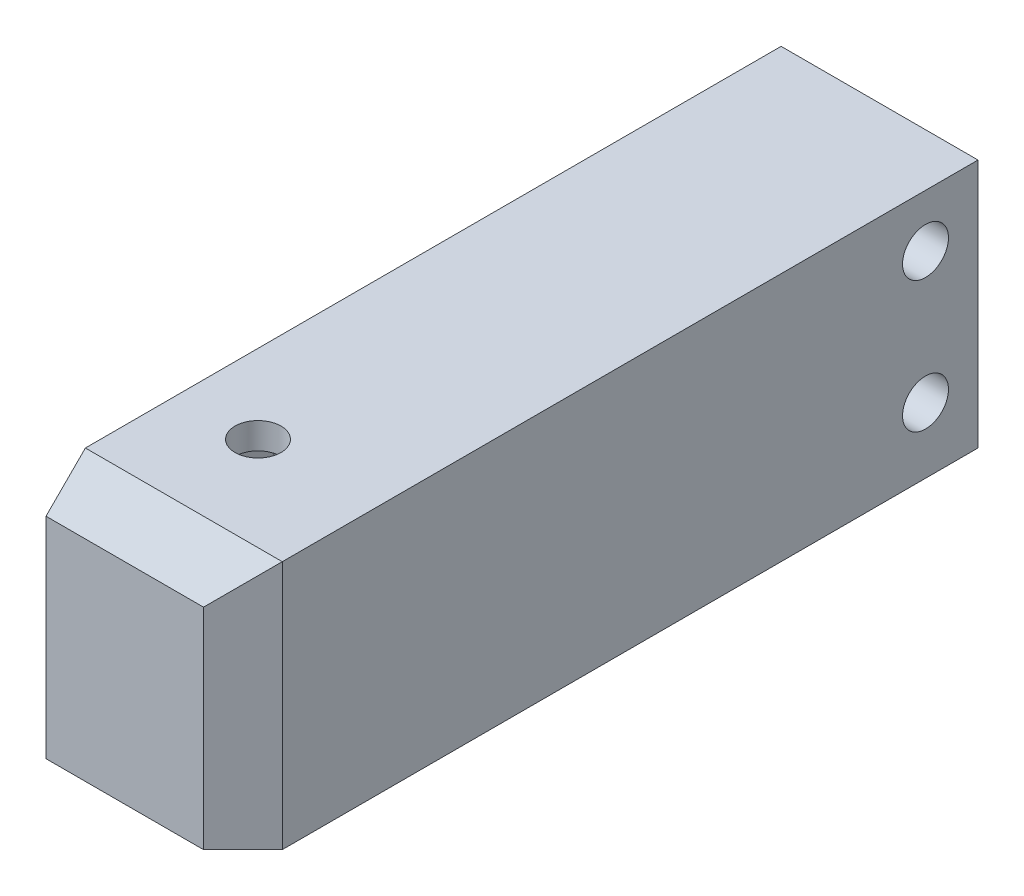
ISO-10303-21;
HEADER;
FILE_DESCRIPTION(('STEP AP214'),'2;1');
FILE_NAME('part.step','',(''),(''),'','','');
FILE_SCHEMA(('AUTOMOTIVE_DESIGN { 1 0 10303 214 1 1 1 1 }'));
ENDSEC;
DATA;
#1=APPLICATION_CONTEXT('core data for automotive mechanical design processes');
#2=APPLICATION_PROTOCOL_DEFINITION('international standard','automotive_design',2000,#1);
#3=PRODUCT_CONTEXT('',#1,'mechanical');
#4=PRODUCT('Part','Part','',(#3));
#5=PRODUCT_RELATED_PRODUCT_CATEGORY('part','',(#4));
#6=PRODUCT_DEFINITION_FORMATION('','',#4);
#7=PRODUCT_DEFINITION_CONTEXT('part definition',#1,'design');
#8=PRODUCT_DEFINITION('design','',#6,#7);
#9=PRODUCT_DEFINITION_SHAPE('','',#8);
#10=(LENGTH_UNIT() NAMED_UNIT(*) SI_UNIT(.MILLI.,.METRE.));
#11=(NAMED_UNIT(*) PLANE_ANGLE_UNIT() SI_UNIT($,.RADIAN.));
#12=(NAMED_UNIT(*) SI_UNIT($,.STERADIAN.) SOLID_ANGLE_UNIT());
#13=UNCERTAINTY_MEASURE_WITH_UNIT(LENGTH_MEASURE(1.E-05),#10,'distance_accuracy_value','');
#14=(GEOMETRIC_REPRESENTATION_CONTEXT(3) GLOBAL_UNCERTAINTY_ASSIGNED_CONTEXT((#13)) GLOBAL_UNIT_ASSIGNED_CONTEXT((#10,
#11,#12)) REPRESENTATION_CONTEXT('',''));
#15=CARTESIAN_POINT('',(0.,0.,0.));
#16=DIRECTION('',(0.,0.,1.));
#17=DIRECTION('',(1.,0.,0.));
#18=AXIS2_PLACEMENT_3D('',#15,#16,#17);
#19=CARTESIAN_POINT('',(-171.,47.,128.35));
#20=DIRECTION('',(0.,1.,0.));
#21=DIRECTION('',(-1.,0.,0.));
#22=AXIS2_PLACEMENT_3D('',#19,#20,#21);
#23=CYLINDRICAL_SURFACE('',#22,1.75);
#24=CARTESIAN_POINT('',(-171.,66.,128.35));
#25=DIRECTION('',(0.,1.,0.));
#26=DIRECTION('',(-1.,0.,0.));
#27=AXIS2_PLACEMENT_3D('',#24,#25,#26);
#28=CIRCLE('',#27,1.75);
#29=CARTESIAN_POINT('',(-172.75,66.,128.35));
#30=VERTEX_POINT('',#29);
#31=EDGE_CURVE('E194',#30,#30,#28,.T.);
#32=ORIENTED_EDGE('',*,*,#31,.T.);
#33=EDGE_LOOP('',(#32));
#34=FACE_BOUND('',#33,.T.);
#35=CARTESIAN_POINT('',(-171.,64.,128.35));
#36=DIRECTION('',(0.,-1.,0.));
#37=DIRECTION('',(1.,0.,0.));
#38=AXIS2_PLACEMENT_3D('',#35,#36,#37);
#39=CIRCLE('',#38,1.75);
#40=CARTESIAN_POINT('',(-169.25,64.,128.35));
#41=VERTEX_POINT('',#40);
#42=EDGE_CURVE('E172',#41,#41,#39,.T.);
#43=ORIENTED_EDGE('',*,*,#42,.T.);
#44=EDGE_LOOP('',(#43));
#45=FACE_BOUND('',#44,.T.);
#46=ADVANCED_FACE('F33',(#34,#45),#23,.F.);
#47=CARTESIAN_POINT('',(-162.,66.,82.5));
#48=DIRECTION('',(0.,0.,-1.));
#49=DIRECTION('',(-1.,0.,0.));
#50=AXIS2_PLACEMENT_3D('',#47,#48,#49);
#51=PLANE('',#50);
#52=DIRECTION('',(0.,-1.,0.));
#53=VECTOR('',#52,1.);
#54=CARTESIAN_POINT('',(-177.,66.,82.5));
#55=LINE('',#54,#53);
#56=CARTESIAN_POINT('',(-177.,66.,82.5));
#57=VERTEX_POINT('',#56);
#58=CARTESIAN_POINT('',(-177.,47.,82.5));
#59=VERTEX_POINT('',#58);
#60=EDGE_CURVE('E263',#57,#59,#55,.T.);
#61=ORIENTED_EDGE('',*,*,#60,.F.);
#62=DIRECTION('',(-1.,0.,0.));
#63=VECTOR('',#62,1.);
#64=CARTESIAN_POINT('',(-162.,66.,82.5));
#65=LINE('',#64,#63);
#66=CARTESIAN_POINT('',(-162.,66.,82.5));
#67=VERTEX_POINT('',#66);
#68=EDGE_CURVE('E274',#67,#57,#65,.T.);
#69=ORIENTED_EDGE('',*,*,#68,.F.);
#70=DIRECTION('',(0.,-1.,0.));
#71=VECTOR('',#70,1.);
#72=CARTESIAN_POINT('',(-162.,66.,82.5));
#73=LINE('',#72,#71);
#74=CARTESIAN_POINT('',(-162.,47.,82.5));
#75=VERTEX_POINT('',#74);
#76=EDGE_CURVE('E253',#67,#75,#73,.T.);
#77=ORIENTED_EDGE('',*,*,#76,.T.);
#78=DIRECTION('',(-1.,0.,0.));
#79=VECTOR('',#78,1.);
#80=CARTESIAN_POINT('',(-162.,47.,82.5));
#81=LINE('',#80,#79);
#82=EDGE_CURVE('E262',#75,#59,#81,.T.);
#83=ORIENTED_EDGE('',*,*,#82,.T.);
#84=EDGE_LOOP('',(#61,#69,#77,#83));
#85=FACE_BOUND('',#84,.T.);
#86=ADVANCED_FACE('F320',(#85),#51,.T.);
#87=CARTESIAN_POINT('',(-162.,66.,138.5));
#88=DIRECTION('',(0.,1.,0.));
#89=DIRECTION('',(-1.,0.,0.));
#90=AXIS2_PLACEMENT_3D('',#87,#88,#89);
#91=PLANE('',#90);
#92=ORIENTED_EDGE('',*,*,#31,.F.);
#93=EDGE_LOOP('',(#92));
#94=FACE_BOUND('',#93,.T.);
#95=DIRECTION('',(0.,0.,-1.));
#96=VECTOR('',#95,1.);
#97=CARTESIAN_POINT('',(-177.,66.,138.5));
#98=LINE('',#97,#96);
#99=CARTESIAN_POINT('',(-177.,66.,135.5));
#100=VERTEX_POINT('',#99);
#101=EDGE_CURVE('E257',#100,#57,#98,.T.);
#102=ORIENTED_EDGE('',*,*,#101,.F.);
#103=DIRECTION('',(1.,0.,0.));
#104=VECTOR('',#103,1.);
#105=CARTESIAN_POINT('',(-162.,66.,135.5));
#106=LINE('',#105,#104);
#107=CARTESIAN_POINT('',(-162.,66.,135.5));
#108=VERTEX_POINT('',#107);
#109=EDGE_CURVE('E11',#100,#108,#106,.T.);
#110=ORIENTED_EDGE('',*,*,#109,.T.);
#111=DIRECTION('',(0.,0.,-1.));
#112=VECTOR('',#111,1.);
#113=CARTESIAN_POINT('',(-162.,66.,138.5));
#114=LINE('',#113,#112);
#115=EDGE_CURVE('E260',#108,#67,#114,.T.);
#116=ORIENTED_EDGE('',*,*,#115,.T.);
#117=ORIENTED_EDGE('',*,*,#68,.T.);
#118=EDGE_LOOP('',(#102,#110,#116,#117));
#119=FACE_BOUND('',#118,.T.);
#120=ADVANCED_FACE('F299',(#94,#119),#91,.T.);
#121=CARTESIAN_POINT('',(-162.,47.,138.5));
#122=DIRECTION('',(0.,0.,1.));
#123=DIRECTION('',(1.,0.,0.));
#124=AXIS2_PLACEMENT_3D('',#121,#122,#123);
#125=PLANE('',#124);
#126=DIRECTION('',(-1.,0.,0.));
#127=VECTOR('',#126,1.);
#128=CARTESIAN_POINT('',(-162.,47.,138.5));
#129=LINE('',#128,#127);
#130=CARTESIAN_POINT('',(-165.,47.,138.5));
#131=VERTEX_POINT('',#130);
#132=CARTESIAN_POINT('',(-177.,47.,138.5));
#133=VERTEX_POINT('',#132);
#134=EDGE_CURVE('E278',#131,#133,#129,.T.);
#135=ORIENTED_EDGE('',*,*,#134,.F.);
#136=DIRECTION('',(0.,1.,0.));
#137=VECTOR('',#136,1.);
#138=CARTESIAN_POINT('',(-165.,66.,138.5));
#139=LINE('',#138,#137);
#140=CARTESIAN_POINT('',(-165.,63.,138.5));
#141=VERTEX_POINT('',#140);
#142=EDGE_CURVE('E283',#131,#141,#139,.T.);
#143=ORIENTED_EDGE('',*,*,#142,.T.);
#144=DIRECTION('',(-1.,0.,0.));
#145=VECTOR('',#144,1.);
#146=CARTESIAN_POINT('',(-162.,63.,138.5));
#147=LINE('',#146,#145);
#148=CARTESIAN_POINT('',(-177.,63.,138.5));
#149=VERTEX_POINT('',#148);
#150=EDGE_CURVE('E277',#141,#149,#147,.T.);
#151=ORIENTED_EDGE('',*,*,#150,.T.);
#152=DIRECTION('',(0.,1.,0.));
#153=VECTOR('',#152,1.);
#154=CARTESIAN_POINT('',(-177.,47.,138.5));
#155=LINE('',#154,#153);
#156=EDGE_CURVE('E270',#133,#149,#155,.T.);
#157=ORIENTED_EDGE('',*,*,#156,.F.);
#158=EDGE_LOOP('',(#135,#143,#151,#157));
#159=FACE_BOUND('',#158,.T.);
#160=ADVANCED_FACE('F380',(#159),#125,.T.);
#161=CARTESIAN_POINT('',(-162.,47.,82.5));
#162=DIRECTION('',(0.,-1.,0.));
#163=DIRECTION('',(1.,0.,0.));
#164=AXIS2_PLACEMENT_3D('',#161,#162,#163);
#165=PLANE('',#164);
#166=CARTESIAN_POINT('',(-171.,47.,108.75));
#167=DIRECTION('',(0.,-1.,0.));
#168=DIRECTION('',(1.,0.,0.));
#169=AXIS2_PLACEMENT_3D('',#166,#167,#168);
#170=CIRCLE('',#169,1.);
#171=CARTESIAN_POINT('',(-170.,47.,108.75));
#172=VERTEX_POINT('',#171);
#173=EDGE_CURVE('E214',#172,#172,#170,.T.);
#174=ORIENTED_EDGE('',*,*,#173,.F.);
#175=EDGE_LOOP('',(#174));
#176=FACE_BOUND('',#175,.T.);
#177=CARTESIAN_POINT('',(-171.,47.,136.25));
#178=DIRECTION('',(0.,-1.,0.));
#179=DIRECTION('',(1.,0.,0.));
#180=AXIS2_PLACEMENT_3D('',#177,#178,#179);
#181=CIRCLE('',#180,1.);
#182=CARTESIAN_POINT('',(-170.,47.,136.25));
#183=VERTEX_POINT('',#182);
#184=EDGE_CURVE('E220',#183,#183,#181,.T.);
#185=ORIENTED_EDGE('',*,*,#184,.F.);
#186=EDGE_LOOP('',(#185));
#187=FACE_BOUND('',#186,.T.);
#188=DIRECTION('',(-1.,0.,0.));
#189=VECTOR('',#188,1.);
#190=CARTESIAN_POINT('',(-164.5,47.,134.5));
#191=LINE('',#190,#189);
#192=CARTESIAN_POINT('',(-164.5,47.,134.5));
#193=VERTEX_POINT('',#192);
#194=CARTESIAN_POINT('',(-177.,47.,134.5));
#195=VERTEX_POINT('',#194);
#196=EDGE_CURVE('E226',#193,#195,#191,.T.);
#197=ORIENTED_EDGE('',*,*,#196,.F.);
#198=DIRECTION('',(0.,0.,1.));
#199=VECTOR('',#198,1.);
#200=CARTESIAN_POINT('',(-164.5,47.,110.5));
#201=LINE('',#200,#199);
#202=CARTESIAN_POINT('',(-164.5,47.,110.5));
#203=VERTEX_POINT('',#202);
#204=EDGE_CURVE('E231',#203,#193,#201,.T.);
#205=ORIENTED_EDGE('',*,*,#204,.F.);
#206=DIRECTION('',(1.,0.,0.));
#207=VECTOR('',#206,1.);
#208=CARTESIAN_POINT('',(-177.,47.,110.5));
#209=LINE('',#208,#207);
#210=CARTESIAN_POINT('',(-177.,47.,110.5));
#211=VERTEX_POINT('',#210);
#212=EDGE_CURVE('E240',#211,#203,#209,.T.);
#213=ORIENTED_EDGE('',*,*,#212,.F.);
#214=DIRECTION('',(0.,0.,1.));
#215=VECTOR('',#214,1.);
#216=CARTESIAN_POINT('',(-177.,47.,82.5));
#217=LINE('',#216,#215);
#218=EDGE_CURVE('E267',#59,#211,#217,.T.);
#219=ORIENTED_EDGE('',*,*,#218,.F.);
#220=ORIENTED_EDGE('',*,*,#82,.F.);
#221=DIRECTION('',(0.,0.,1.));
#222=VECTOR('',#221,1.);
#223=CARTESIAN_POINT('',(-162.,47.,82.5));
#224=LINE('',#223,#222);
#225=CARTESIAN_POINT('',(-162.,47.,135.5));
#226=VERTEX_POINT('',#225);
#227=EDGE_CURVE('E256',#75,#226,#224,.T.);
#228=ORIENTED_EDGE('',*,*,#227,.T.);
#229=DIRECTION('',(-0.707106781186546,0.,0.707106781186549));
#230=VECTOR('',#229,1.);
#231=CARTESIAN_POINT('',(-135.5,47.,109.));
#232=LINE('',#231,#230);
#233=EDGE_CURVE('E288',#226,#131,#232,.T.);
#234=ORIENTED_EDGE('',*,*,#233,.T.);
#235=ORIENTED_EDGE('',*,*,#134,.T.);
#236=EDGE_CURVE('E266',#195,#133,#217,.T.);
#237=ORIENTED_EDGE('',*,*,#236,.F.);
#238=EDGE_LOOP('',(#197,#205,#213,#219,#220,#228,#234,#235,#237));
#239=FACE_BOUND('',#238,.T.);
#240=ADVANCED_FACE('F315',(#176,#187,#239),#165,.T.);
#241=CARTESIAN_POINT('',(-162.,-2.55234430082246E-13,0.));
#242=DIRECTION('',(-1.,0.,0.));
#243=DIRECTION('',(0.,-1.,0.));
#244=AXIS2_PLACEMENT_3D('',#241,#242,#243);
#245=PLANE('',#244);
#246=CARTESIAN_POINT('',(-162.,61.9999999999998,86.5));
#247=DIRECTION('',(1.,0.,0.));
#248=DIRECTION('',(0.,0.,-1.));
#249=AXIS2_PLACEMENT_3D('',#246,#247,#248);
#250=CIRCLE('',#249,1.75);
#251=CARTESIAN_POINT('',(-162.,61.9999999999998,84.75));
#252=VERTEX_POINT('',#251);
#253=EDGE_CURVE('E205',#252,#252,#250,.T.);
#254=ORIENTED_EDGE('',*,*,#253,.F.);
#255=EDGE_LOOP('',(#254));
#256=FACE_BOUND('',#255,.T.);
#257=CARTESIAN_POINT('',(-162.,51.9999999999998,86.5));
#258=DIRECTION('',(1.,0.,0.));
#259=DIRECTION('',(0.,0.,-1.));
#260=AXIS2_PLACEMENT_3D('',#257,#258,#259);
#261=CIRCLE('',#260,1.75);
#262=CARTESIAN_POINT('',(-162.,51.9999999999998,84.75));
#263=VERTEX_POINT('',#262);
#264=EDGE_CURVE('E208',#263,#263,#261,.T.);
#265=ORIENTED_EDGE('',*,*,#264,.F.);
#266=EDGE_LOOP('',(#265));
#267=FACE_BOUND('',#266,.T.);
#268=ORIENTED_EDGE('',*,*,#115,.F.);
#269=DIRECTION('',(0.,-1.,0.));
#270=VECTOR('',#269,1.);
#271=CARTESIAN_POINT('',(-162.,47.,135.5));
#272=LINE('',#271,#270);
#273=EDGE_CURVE('E286',#108,#226,#272,.T.);
#274=ORIENTED_EDGE('',*,*,#273,.T.);
#275=ORIENTED_EDGE('',*,*,#227,.F.);
#276=ORIENTED_EDGE('',*,*,#76,.F.);
#277=EDGE_LOOP('',(#268,#274,#275,#276));
#278=FACE_BOUND('',#277,.T.);
#279=ADVANCED_FACE('F311',(#256,#267,#278),#245,.F.);
#280=CARTESIAN_POINT('',(-177.,-2.58565099156122E-13,0.));
#281=DIRECTION('',(-1.,0.,0.));
#282=DIRECTION('',(0.,-1.,0.));
#283=AXIS2_PLACEMENT_3D('',#280,#281,#282);
#284=PLANE('',#283);
#285=CARTESIAN_POINT('',(-177.,61.9999999999998,86.5));
#286=DIRECTION('',(-1.,0.,0.));
#287=DIRECTION('',(0.,-1.,0.));
#288=AXIS2_PLACEMENT_3D('',#285,#286,#287);
#289=CIRCLE('',#288,1.75);
#290=CARTESIAN_POINT('',(-177.,60.2499999999998,86.5));
#291=VERTEX_POINT('',#290);
#292=EDGE_CURVE('E204',#291,#291,#289,.F.);
#293=ORIENTED_EDGE('',*,*,#292,.T.);
#294=EDGE_LOOP('',(#293));
#295=FACE_BOUND('',#294,.T.);
#296=CARTESIAN_POINT('',(-177.,51.9999999999998,86.5));
#297=DIRECTION('',(1.,0.,0.));
#298=DIRECTION('',(0.,0.,-1.));
#299=AXIS2_PLACEMENT_3D('',#296,#297,#298);
#300=CIRCLE('',#299,1.75);
#301=CARTESIAN_POINT('',(-177.,51.9999999999998,84.75));
#302=VERTEX_POINT('',#301);
#303=EDGE_CURVE('E211',#302,#302,#300,.T.);
#304=ORIENTED_EDGE('',*,*,#303,.T.);
#305=EDGE_LOOP('',(#304));
#306=FACE_BOUND('',#305,.T.);
#307=DIRECTION('',(0.,-1.,0.));
#308=VECTOR('',#307,1.);
#309=CARTESIAN_POINT('',(-177.,62.,134.5));
#310=LINE('',#309,#308);
#311=CARTESIAN_POINT('',(-177.,62.,134.5));
#312=VERTEX_POINT('',#311);
#313=EDGE_CURVE('E238',#312,#195,#310,.T.);
#314=ORIENTED_EDGE('',*,*,#313,.T.);
#315=ORIENTED_EDGE('',*,*,#236,.T.);
#316=ORIENTED_EDGE('',*,*,#156,.T.);
#317=DIRECTION('',(0.,-0.707106781186546,0.707106781186549));
#318=VECTOR('',#317,1.);
#319=CARTESIAN_POINT('',(-177.,100.75,100.75));
#320=LINE('',#319,#318);
#321=EDGE_CURVE('E42',#149,#100,#320,.F.);
#322=ORIENTED_EDGE('',*,*,#321,.T.);
#323=ORIENTED_EDGE('',*,*,#101,.T.);
#324=ORIENTED_EDGE('',*,*,#60,.T.);
#325=ORIENTED_EDGE('',*,*,#218,.T.);
#326=DIRECTION('',(0.,-1.,0.));
#327=VECTOR('',#326,1.);
#328=CARTESIAN_POINT('',(-177.,62.,110.5));
#329=LINE('',#328,#327);
#330=CARTESIAN_POINT('',(-177.,62.,110.5));
#331=VERTEX_POINT('',#330);
#332=EDGE_CURVE('E249',#331,#211,#329,.T.);
#333=ORIENTED_EDGE('',*,*,#332,.F.);
#334=DIRECTION('',(0.,0.,-1.));
#335=VECTOR('',#334,1.);
#336=CARTESIAN_POINT('',(-177.,62.,134.5));
#337=LINE('',#336,#335);
#338=EDGE_CURVE('E230',#312,#331,#337,.T.);
#339=ORIENTED_EDGE('',*,*,#338,.F.);
#340=EDGE_LOOP('',(#314,#315,#316,#322,#323,#324,#325,#333,#339));
#341=FACE_BOUND('',#340,.T.);
#342=ADVANCED_FACE('F293',(#295,#306,#341),#284,.T.);
#343=CARTESIAN_POINT('',(-162.,63.,138.5));
#344=DIRECTION('',(0.,-0.707106781186549,-0.707106781186546));
#345=DIRECTION('',(-1.,0.,0.));
#346=AXIS2_PLACEMENT_3D('',#343,#344,#345);
#347=PLANE('',#346);
#348=ORIENTED_EDGE('',*,*,#321,.F.);
#349=ORIENTED_EDGE('',*,*,#150,.F.);
#350=DIRECTION('',(-0.577350269189625,-0.577350269189625,0.577350269189628));
#351=VECTOR('',#350,1.);
#352=CARTESIAN_POINT('',(-164.,64.,137.5));
#353=LINE('',#352,#351);
#354=EDGE_CURVE('E37',#108,#141,#353,.T.);
#355=ORIENTED_EDGE('',*,*,#354,.F.);
#356=ORIENTED_EDGE('',*,*,#109,.F.);
#357=EDGE_LOOP('',(#348,#349,#355,#356));
#358=FACE_BOUND('',#357,.T.);
#359=ADVANCED_FACE('F35',(#358),#347,.F.);
#360=CARTESIAN_POINT('',(-165.,47.,138.5));
#361=DIRECTION('',(0.707106781186549,0.,0.707106781186546));
#362=DIRECTION('',(0.,-1.,0.));
#363=AXIS2_PLACEMENT_3D('',#360,#361,#362);
#364=PLANE('',#363);
#365=ORIENTED_EDGE('',*,*,#233,.F.);
#366=ORIENTED_EDGE('',*,*,#273,.F.);
#367=ORIENTED_EDGE('',*,*,#354,.T.);
#368=ORIENTED_EDGE('',*,*,#142,.F.);
#369=EDGE_LOOP('',(#365,#366,#367,#368));
#370=FACE_BOUND('',#369,.T.);
#371=ADVANCED_FACE('F308',(#370),#364,.T.);
#372=CARTESIAN_POINT('',(-164.5,62.,134.5));
#373=DIRECTION('',(0.,0.,1.));
#374=DIRECTION('',(1.,0.,0.));
#375=AXIS2_PLACEMENT_3D('',#372,#373,#374);
#376=PLANE('',#375);
#377=ORIENTED_EDGE('',*,*,#196,.T.);
#378=ORIENTED_EDGE('',*,*,#313,.F.);
#379=DIRECTION('',(-1.,0.,0.));
#380=VECTOR('',#379,1.);
#381=CARTESIAN_POINT('',(-164.5,62.,134.5));
#382=LINE('',#381,#380);
#383=CARTESIAN_POINT('',(-164.5,62.,134.5));
#384=VERTEX_POINT('',#383);
#385=EDGE_CURVE('E57',#384,#312,#382,.T.);
#386=ORIENTED_EDGE('',*,*,#385,.F.);
#387=DIRECTION('',(0.,-1.,0.));
#388=VECTOR('',#387,1.);
#389=CARTESIAN_POINT('',(-164.5,62.,134.5));
#390=LINE('',#389,#388);
#391=EDGE_CURVE('E245',#384,#193,#390,.T.);
#392=ORIENTED_EDGE('',*,*,#391,.T.);
#393=EDGE_LOOP('',(#377,#378,#386,#392));
#394=FACE_BOUND('',#393,.T.);
#395=ADVANCED_FACE('F394',(#394),#376,.F.);
#396=CARTESIAN_POINT('',(-164.5,62.,110.5));
#397=DIRECTION('',(1.,0.,0.));
#398=DIRECTION('',(0.,1.,0.));
#399=AXIS2_PLACEMENT_3D('',#396,#397,#398);
#400=PLANE('',#399);
#401=ORIENTED_EDGE('',*,*,#204,.T.);
#402=ORIENTED_EDGE('',*,*,#391,.F.);
#403=DIRECTION('',(0.,0.,1.));
#404=VECTOR('',#403,1.);
#405=CARTESIAN_POINT('',(-164.5,62.,110.5));
#406=LINE('',#405,#404);
#407=CARTESIAN_POINT('',(-164.5,62.,110.5));
#408=VERTEX_POINT('',#407);
#409=EDGE_CURVE('E236',#408,#384,#406,.T.);
#410=ORIENTED_EDGE('',*,*,#409,.F.);
#411=DIRECTION('',(0.,-1.,0.));
#412=VECTOR('',#411,1.);
#413=CARTESIAN_POINT('',(-164.5,62.,110.5));
#414=LINE('',#413,#412);
#415=EDGE_CURVE('E247',#408,#203,#414,.T.);
#416=ORIENTED_EDGE('',*,*,#415,.T.);
#417=EDGE_LOOP('',(#401,#402,#410,#416));
#418=FACE_BOUND('',#417,.T.);
#419=ADVANCED_FACE('F328',(#418),#400,.F.);
#420=CARTESIAN_POINT('',(-177.,62.,110.5));
#421=DIRECTION('',(0.,0.,-1.));
#422=DIRECTION('',(-1.,0.,0.));
#423=AXIS2_PLACEMENT_3D('',#420,#421,#422);
#424=PLANE('',#423);
#425=ORIENTED_EDGE('',*,*,#212,.T.);
#426=ORIENTED_EDGE('',*,*,#415,.F.);
#427=DIRECTION('',(1.,0.,0.));
#428=VECTOR('',#427,1.);
#429=CARTESIAN_POINT('',(-177.,62.,110.5));
#430=LINE('',#429,#428);
#431=EDGE_CURVE('E233',#331,#408,#430,.T.);
#432=ORIENTED_EDGE('',*,*,#431,.F.);
#433=ORIENTED_EDGE('',*,*,#332,.T.);
#434=EDGE_LOOP('',(#425,#426,#432,#433));
#435=FACE_BOUND('',#434,.T.);
#436=ADVANCED_FACE('F324',(#435),#424,.F.);
#437=CARTESIAN_POINT('',(0.,62.0000000000001,0.));
#438=DIRECTION('',(0.,-1.,0.));
#439=DIRECTION('',(1.,0.,0.));
#440=AXIS2_PLACEMENT_3D('',#437,#438,#439);
#441=PLANE('',#440);
#442=DIRECTION('',(0.499999999999894,0.,-0.8660254037845));
#443=VECTOR('',#442,1.);
#444=CARTESIAN_POINT('',(-174.299999999999,62.,128.35));
#445=LINE('',#444,#443);
#446=CARTESIAN_POINT('',(-174.299999999999,62.,128.35));
#447=VERTEX_POINT('',#446);
#448=CARTESIAN_POINT('',(-172.649999999999,62.,125.49211616751));
#449=VERTEX_POINT('',#448);
#450=EDGE_CURVE('E49',#447,#449,#445,.T.);
#451=ORIENTED_EDGE('',*,*,#450,.F.);
#452=DIRECTION('',(-0.499999999999997,0.,-0.86602540378444));
#453=VECTOR('',#452,1.);
#454=CARTESIAN_POINT('',(-172.650000000003,62.,131.207883832482));
#455=LINE('',#454,#453);
#456=CARTESIAN_POINT('',(-172.650000000003,62.,131.207883832482));
#457=VERTEX_POINT('',#456);
#458=EDGE_CURVE('E166',#457,#447,#455,.T.);
#459=ORIENTED_EDGE('',*,*,#458,.F.);
#460=DIRECTION('',(-1.,0.,0.));
#461=VECTOR('',#460,1.);
#462=CARTESIAN_POINT('',(-169.350000000002,62.,131.207883832482));
#463=LINE('',#462,#461);
#464=CARTESIAN_POINT('',(-169.350000000002,62.,131.207883832482));
#465=VERTEX_POINT('',#464);
#466=EDGE_CURVE('E169',#465,#457,#463,.T.);
#467=ORIENTED_EDGE('',*,*,#466,.F.);
#468=DIRECTION('',(-0.500000000001457,0.,0.866025403783598));
#469=VECTOR('',#468,1.);
#470=CARTESIAN_POINT('',(-167.7,62.,128.35));
#471=LINE('',#470,#469);
#472=CARTESIAN_POINT('',(-167.7,62.,128.35));
#473=VERTEX_POINT('',#472);
#474=EDGE_CURVE('E187',#473,#465,#471,.T.);
#475=ORIENTED_EDGE('',*,*,#474,.F.);
#476=DIRECTION('',(0.499999999999924,0.,0.866025403784483));
#477=VECTOR('',#476,1.);
#478=CARTESIAN_POINT('',(-169.35,62.,125.49211616751));
#479=LINE('',#478,#477);
#480=CARTESIAN_POINT('',(-169.35,62.,125.49211616751));
#481=VERTEX_POINT('',#480);
#482=EDGE_CURVE('E184',#481,#473,#479,.T.);
#483=ORIENTED_EDGE('',*,*,#482,.F.);
#484=DIRECTION('',(1.,0.,-1.09340146364618E-13));
#485=VECTOR('',#484,1.);
#486=CARTESIAN_POINT('',(-172.649999999999,62.,125.49211616751));
#487=LINE('',#486,#485);
#488=EDGE_CURVE('E182',#449,#481,#487,.T.);
#489=ORIENTED_EDGE('',*,*,#488,.F.);
#490=EDGE_LOOP('',(#451,#459,#467,#475,#483,#489));
#491=FACE_BOUND('',#490,.T.);
#492=ORIENTED_EDGE('',*,*,#385,.T.);
#493=ORIENTED_EDGE('',*,*,#338,.T.);
#494=ORIENTED_EDGE('',*,*,#431,.T.);
#495=ORIENTED_EDGE('',*,*,#409,.T.);
#496=EDGE_LOOP('',(#492,#493,#494,#495));
#497=FACE_BOUND('',#496,.T.);
#498=ADVANCED_FACE('F330',(#491,#497),#441,.T.);
#499=CARTESIAN_POINT('',(-171.,62.,136.25));
#500=DIRECTION('',(0.,-1.,0.));
#501=DIRECTION('',(1.,0.,0.));
#502=AXIS2_PLACEMENT_3D('',#499,#500,#501);
#503=CYLINDRICAL_SURFACE('',#502,1.);
#504=CARTESIAN_POINT('',(-171.,62.,136.25));
#505=DIRECTION('',(0.,-1.,0.));
#506=DIRECTION('',(1.,0.,0.));
#507=AXIS2_PLACEMENT_3D('',#504,#505,#506);
#508=CIRCLE('',#507,1.);
#509=CARTESIAN_POINT('',(-170.,62.,136.25));
#510=VERTEX_POINT('',#509);
#511=EDGE_CURVE('E223',#510,#510,#508,.T.);
#512=ORIENTED_EDGE('',*,*,#511,.F.);
#513=EDGE_LOOP('',(#512));
#514=FACE_BOUND('',#513,.T.);
#515=ORIENTED_EDGE('',*,*,#184,.T.);
#516=EDGE_LOOP('',(#515));
#517=FACE_BOUND('',#516,.T.);
#518=ADVANCED_FACE('F332',(#514,#517),#503,.F.);
#519=CARTESIAN_POINT('',(-171.,62.,136.25));
#520=DIRECTION('',(0.,-1.,0.));
#521=DIRECTION('',(1.,0.,0.));
#522=AXIS2_PLACEMENT_3D('',#519,#520,#521);
#523=PLANE('',#522);
#524=ORIENTED_EDGE('',*,*,#511,.T.);
#525=EDGE_LOOP('',(#524));
#526=FACE_BOUND('',#525,.T.);
#527=ADVANCED_FACE('F339',(#526),#523,.T.);
#528=CARTESIAN_POINT('',(-171.,62.,108.75));
#529=DIRECTION('',(0.,-1.,0.));
#530=DIRECTION('',(1.,0.,0.));
#531=AXIS2_PLACEMENT_3D('',#528,#529,#530);
#532=CYLINDRICAL_SURFACE('',#531,1.);
#533=CARTESIAN_POINT('',(-171.,62.,108.75));
#534=DIRECTION('',(0.,-1.,0.));
#535=DIRECTION('',(1.,0.,0.));
#536=AXIS2_PLACEMENT_3D('',#533,#534,#535);
#537=CIRCLE('',#536,1.);
#538=CARTESIAN_POINT('',(-170.,62.,108.75));
#539=VERTEX_POINT('',#538);
#540=EDGE_CURVE('E217',#539,#539,#537,.T.);
#541=ORIENTED_EDGE('',*,*,#540,.F.);
#542=EDGE_LOOP('',(#541));
#543=FACE_BOUND('',#542,.T.);
#544=ORIENTED_EDGE('',*,*,#173,.T.);
#545=EDGE_LOOP('',(#544));
#546=FACE_BOUND('',#545,.T.);
#547=ADVANCED_FACE('F366',(#543,#546),#532,.F.);
#548=CARTESIAN_POINT('',(-171.,62.,108.75));
#549=DIRECTION('',(0.,-1.,0.));
#550=DIRECTION('',(1.,0.,0.));
#551=AXIS2_PLACEMENT_3D('',#548,#549,#550);
#552=PLANE('',#551);
#553=ORIENTED_EDGE('',*,*,#540,.T.);
#554=EDGE_LOOP('',(#553));
#555=FACE_BOUND('',#554,.T.);
#556=ADVANCED_FACE('F362',(#555),#552,.T.);
#557=CARTESIAN_POINT('',(-177.,51.9999999999998,86.5));
#558=DIRECTION('',(1.,0.,0.));
#559=DIRECTION('',(0.,0.,-1.));
#560=AXIS2_PLACEMENT_3D('',#557,#558,#559);
#561=CYLINDRICAL_SURFACE('',#560,1.75);
#562=ORIENTED_EDGE('',*,*,#303,.F.);
#563=EDGE_LOOP('',(#562));
#564=FACE_BOUND('',#563,.T.);
#565=ORIENTED_EDGE('',*,*,#264,.T.);
#566=EDGE_LOOP('',(#565));
#567=FACE_BOUND('',#566,.T.);
#568=ADVANCED_FACE('F358',(#564,#567),#561,.F.);
#569=CARTESIAN_POINT('',(-177.001,61.9999999999998,86.5));
#570=DIRECTION('',(1.,0.,0.));
#571=DIRECTION('',(0.,0.,-1.));
#572=AXIS2_PLACEMENT_3D('',#569,#570,#571);
#573=CYLINDRICAL_SURFACE('',#572,1.75);
#574=ORIENTED_EDGE('',*,*,#292,.F.);
#575=EDGE_LOOP('',(#574));
#576=FACE_BOUND('',#575,.T.);
#577=ORIENTED_EDGE('',*,*,#253,.T.);
#578=EDGE_LOOP('',(#577));
#579=FACE_BOUND('',#578,.T.);
#580=ADVANCED_FACE('F355',(#576,#579),#573,.F.);
#581=CARTESIAN_POINT('',(-174.299999999999,64.,128.35));
#582=DIRECTION('',(-0.8660254037845,0.,-0.499999999999894));
#583=DIRECTION('',(-0.499999999999894,0.,0.8660254037845));
#584=AXIS2_PLACEMENT_3D('',#581,#582,#583);
#585=PLANE('',#584);
#586=ORIENTED_EDGE('',*,*,#450,.T.);
#587=DIRECTION('',(0.,-1.,0.));
#588=VECTOR('',#587,1.);
#589=CARTESIAN_POINT('',(-172.649999999999,64.,125.49211616751));
#590=LINE('',#589,#588);
#591=CARTESIAN_POINT('',(-172.649999999999,64.,125.49211616751));
#592=VERTEX_POINT('',#591);
#593=EDGE_CURVE('E143',#592,#449,#590,.T.);
#594=ORIENTED_EDGE('',*,*,#593,.F.);
#595=DIRECTION('',(0.499999999999894,0.,-0.8660254037845));
#596=VECTOR('',#595,1.);
#597=CARTESIAN_POINT('',(-174.299999999999,64.,128.35));
#598=LINE('',#597,#596);
#599=CARTESIAN_POINT('',(-174.299999999999,64.,128.35));
#600=VERTEX_POINT('',#599);
#601=EDGE_CURVE('E147',#600,#592,#598,.T.);
#602=ORIENTED_EDGE('',*,*,#601,.F.);
#603=DIRECTION('',(0.,-1.,0.));
#604=VECTOR('',#603,1.);
#605=CARTESIAN_POINT('',(-174.299999999999,64.,128.35));
#606=LINE('',#605,#604);
#607=EDGE_CURVE('E192',#600,#447,#606,.T.);
#608=ORIENTED_EDGE('',*,*,#607,.T.);
#609=EDGE_LOOP('',(#586,#594,#602,#608));
#610=FACE_BOUND('',#609,.T.);
#611=ADVANCED_FACE('F145',(#610),#585,.F.);
#612=CARTESIAN_POINT('',(-172.650000000003,64.,131.207883832482));
#613=DIRECTION('',(-0.86602540378444,0.,0.499999999999997));
#614=DIRECTION('',(0.499999999999997,0.,0.86602540378444));
#615=AXIS2_PLACEMENT_3D('',#612,#613,#614);
#616=PLANE('',#615);
#617=ORIENTED_EDGE('',*,*,#458,.T.);
#618=ORIENTED_EDGE('',*,*,#607,.F.);
#619=DIRECTION('',(-0.499999999999997,0.,-0.86602540378444));
#620=VECTOR('',#619,1.);
#621=CARTESIAN_POINT('',(-172.650000000003,64.,131.207883832482));
#622=LINE('',#621,#620);
#623=CARTESIAN_POINT('',(-172.650000000003,64.,131.207883832482));
#624=VERTEX_POINT('',#623);
#625=EDGE_CURVE('E153',#624,#600,#622,.T.);
#626=ORIENTED_EDGE('',*,*,#625,.F.);
#627=DIRECTION('',(0.,-1.,0.));
#628=VECTOR('',#627,1.);
#629=CARTESIAN_POINT('',(-172.650000000003,64.,131.207883832482));
#630=LINE('',#629,#628);
#631=EDGE_CURVE('E195',#624,#457,#630,.T.);
#632=ORIENTED_EDGE('',*,*,#631,.T.);
#633=EDGE_LOOP('',(#617,#618,#626,#632));
#634=FACE_BOUND('',#633,.T.);
#635=ADVANCED_FACE('F507',(#634),#616,.F.);
#636=CARTESIAN_POINT('',(-169.350000000002,64.,131.207883832482));
#637=DIRECTION('',(0.,0.,1.));
#638=DIRECTION('',(1.,0.,0.));
#639=AXIS2_PLACEMENT_3D('',#636,#637,#638);
#640=PLANE('',#639);
#641=ORIENTED_EDGE('',*,*,#466,.T.);
#642=ORIENTED_EDGE('',*,*,#631,.F.);
#643=DIRECTION('',(-1.,0.,0.));
#644=VECTOR('',#643,1.);
#645=CARTESIAN_POINT('',(-169.350000000002,64.,131.207883832482));
#646=LINE('',#645,#644);
#647=CARTESIAN_POINT('',(-169.350000000002,64.,131.207883832482));
#648=VERTEX_POINT('',#647);
#649=EDGE_CURVE('E178',#648,#624,#646,.T.);
#650=ORIENTED_EDGE('',*,*,#649,.F.);
#651=DIRECTION('',(0.,-1.,0.));
#652=VECTOR('',#651,1.);
#653=CARTESIAN_POINT('',(-169.350000000002,64.,131.207883832482));
#654=LINE('',#653,#652);
#655=EDGE_CURVE('E197',#648,#465,#654,.T.);
#656=ORIENTED_EDGE('',*,*,#655,.T.);
#657=EDGE_LOOP('',(#641,#642,#650,#656));
#658=FACE_BOUND('',#657,.T.);
#659=ADVANCED_FACE('F513',(#658),#640,.F.);
#660=CARTESIAN_POINT('',(-167.7,64.,128.35));
#661=DIRECTION('',(0.866025403783598,0.,0.500000000001457));
#662=DIRECTION('',(0.500000000001457,0.,-0.866025403783598));
#663=AXIS2_PLACEMENT_3D('',#660,#661,#662);
#664=PLANE('',#663);
#665=ORIENTED_EDGE('',*,*,#474,.T.);
#666=ORIENTED_EDGE('',*,*,#655,.F.);
#667=DIRECTION('',(-0.500000000001457,0.,0.866025403783598));
#668=VECTOR('',#667,1.);
#669=CARTESIAN_POINT('',(-167.7,64.,128.35));
#670=LINE('',#669,#668);
#671=CARTESIAN_POINT('',(-167.7,64.,128.35));
#672=VERTEX_POINT('',#671);
#673=EDGE_CURVE('E175',#672,#648,#670,.T.);
#674=ORIENTED_EDGE('',*,*,#673,.F.);
#675=DIRECTION('',(0.,-1.,0.));
#676=VECTOR('',#675,1.);
#677=CARTESIAN_POINT('',(-167.7,64.,128.35));
#678=LINE('',#677,#676);
#679=EDGE_CURVE('E199',#672,#473,#678,.T.);
#680=ORIENTED_EDGE('',*,*,#679,.T.);
#681=EDGE_LOOP('',(#665,#666,#674,#680));
#682=FACE_BOUND('',#681,.T.);
#683=ADVANCED_FACE('F521',(#682),#664,.F.);
#684=CARTESIAN_POINT('',(-169.35,64.,125.49211616751));
#685=DIRECTION('',(0.866025403784483,0.,-0.499999999999924));
#686=DIRECTION('',(-0.499999999999924,0.,-0.866025403784483));
#687=AXIS2_PLACEMENT_3D('',#684,#685,#686);
#688=PLANE('',#687);
#689=ORIENTED_EDGE('',*,*,#482,.T.);
#690=ORIENTED_EDGE('',*,*,#679,.F.);
#691=DIRECTION('',(0.499999999999924,0.,0.866025403784483));
#692=VECTOR('',#691,1.);
#693=CARTESIAN_POINT('',(-169.35,64.,125.49211616751));
#694=LINE('',#693,#692);
#695=CARTESIAN_POINT('',(-169.35,64.,125.49211616751));
#696=VERTEX_POINT('',#695);
#697=EDGE_CURVE('E161',#696,#672,#694,.T.);
#698=ORIENTED_EDGE('',*,*,#697,.F.);
#699=DIRECTION('',(0.,-1.,0.));
#700=VECTOR('',#699,1.);
#701=CARTESIAN_POINT('',(-169.35,64.,125.49211616751));
#702=LINE('',#701,#700);
#703=EDGE_CURVE('E152',#696,#481,#702,.T.);
#704=ORIENTED_EDGE('',*,*,#703,.T.);
#705=EDGE_LOOP('',(#689,#690,#698,#704));
#706=FACE_BOUND('',#705,.T.);
#707=ADVANCED_FACE('F529',(#706),#688,.F.);
#708=CARTESIAN_POINT('',(-172.649999999999,64.,125.49211616751));
#709=DIRECTION('',(-1.09340146364618E-13,0.,-1.));
#710=DIRECTION('',(-1.,0.,1.09340146364618E-13));
#711=AXIS2_PLACEMENT_3D('',#708,#709,#710);
#712=PLANE('',#711);
#713=ORIENTED_EDGE('',*,*,#488,.T.);
#714=ORIENTED_EDGE('',*,*,#703,.F.);
#715=DIRECTION('',(1.,0.,-1.09340146364618E-13));
#716=VECTOR('',#715,1.);
#717=CARTESIAN_POINT('',(-172.649999999999,64.,125.49211616751));
#718=LINE('',#717,#716);
#719=EDGE_CURVE('E156',#592,#696,#718,.T.);
#720=ORIENTED_EDGE('',*,*,#719,.F.);
#721=ORIENTED_EDGE('',*,*,#593,.T.);
#722=EDGE_LOOP('',(#713,#714,#720,#721));
#723=FACE_BOUND('',#722,.T.);
#724=ADVANCED_FACE('F157',(#723),#712,.F.);
#725=CARTESIAN_POINT('',(0.,64.,0.));
#726=DIRECTION('',(0.,-1.,0.));
#727=DIRECTION('',(0.,0.,-1.));
#728=AXIS2_PLACEMENT_3D('',#725,#726,#727);
#729=PLANE('',#728);
#730=ORIENTED_EDGE('',*,*,#42,.F.);
#731=EDGE_LOOP('',(#730));
#732=FACE_BOUND('',#731,.T.);
#733=ORIENTED_EDGE('',*,*,#601,.T.);
#734=ORIENTED_EDGE('',*,*,#719,.T.);
#735=ORIENTED_EDGE('',*,*,#697,.T.);
#736=ORIENTED_EDGE('',*,*,#673,.T.);
#737=ORIENTED_EDGE('',*,*,#649,.T.);
#738=ORIENTED_EDGE('',*,*,#625,.T.);
#739=EDGE_LOOP('',(#733,#734,#735,#736,#737,#738));
#740=FACE_BOUND('',#739,.T.);
#741=ADVANCED_FACE('F163',(#732,#740),#729,.T.);
#742=CLOSED_SHELL('',(#46,#86,#120,#160,#240,#279,#342,#359,#371,#395,#419,#436,#498,#518,#527,
#547,#556,#568,#580,#611,#635,#659,#683,#707,#724,#741));
#743=MANIFOLD_SOLID_BREP('B2',#742);
#744=ADVANCED_BREP_SHAPE_REPRESENTATION('',(#18,#743),#14);
#745=SHAPE_DEFINITION_REPRESENTATION(#9,#744);
ENDSEC;
END-ISO-10303-21;
